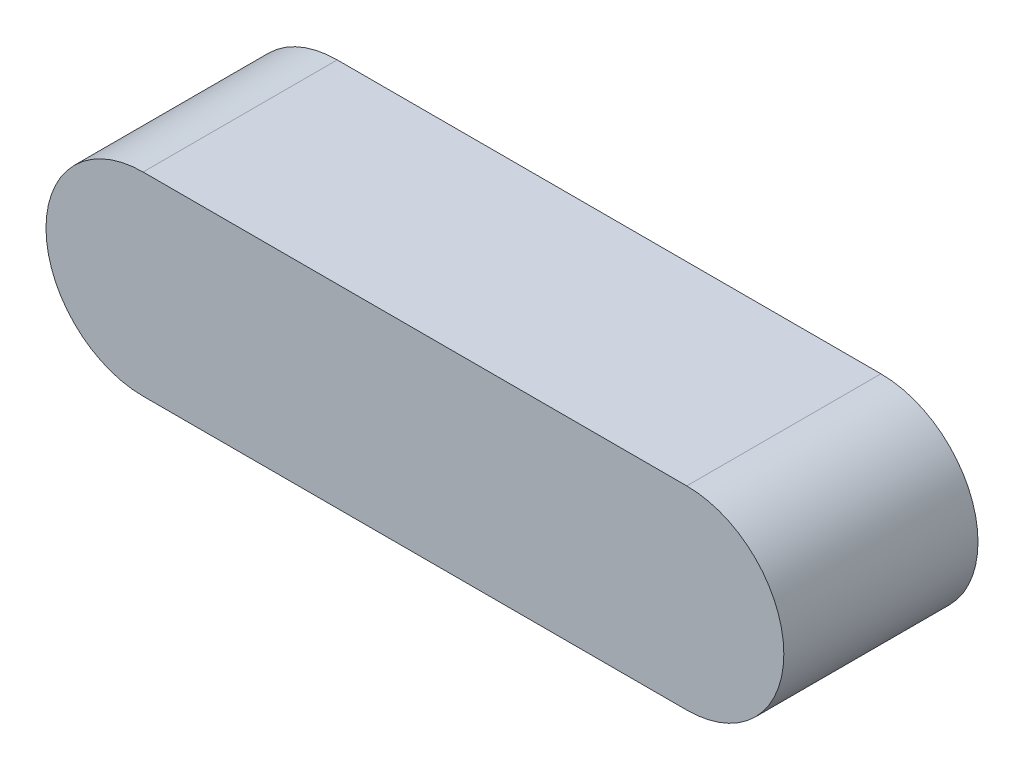
ISO-10303-21;
HEADER;
FILE_DESCRIPTION(('STEP AP214'),'2;1');
FILE_NAME('part.step','',(''),(''),'','','');
FILE_SCHEMA(('AUTOMOTIVE_DESIGN { 1 0 10303 214 1 1 1 1 }'));
ENDSEC;
DATA;
#1=APPLICATION_CONTEXT('core data for automotive mechanical design processes');
#2=APPLICATION_PROTOCOL_DEFINITION('international standard','automotive_design',2000,#1);
#3=PRODUCT_CONTEXT('',#1,'mechanical');
#4=PRODUCT('Part','Part','',(#3));
#5=PRODUCT_RELATED_PRODUCT_CATEGORY('part','',(#4));
#6=PRODUCT_DEFINITION_FORMATION('','',#4);
#7=PRODUCT_DEFINITION_CONTEXT('part definition',#1,'design');
#8=PRODUCT_DEFINITION('design','',#6,#7);
#9=PRODUCT_DEFINITION_SHAPE('','',#8);
#10=(LENGTH_UNIT() NAMED_UNIT(*) SI_UNIT(.MILLI.,.METRE.));
#11=(NAMED_UNIT(*) PLANE_ANGLE_UNIT() SI_UNIT($,.RADIAN.));
#12=(NAMED_UNIT(*) SI_UNIT($,.STERADIAN.) SOLID_ANGLE_UNIT());
#13=UNCERTAINTY_MEASURE_WITH_UNIT(LENGTH_MEASURE(1.E-05),#10,'distance_accuracy_value','');
#14=(GEOMETRIC_REPRESENTATION_CONTEXT(3) GLOBAL_UNCERTAINTY_ASSIGNED_CONTEXT((#13)) GLOBAL_UNIT_ASSIGNED_CONTEXT((#10,
#11,#12)) REPRESENTATION_CONTEXT('',''));
#15=CARTESIAN_POINT('',(0.,0.,0.));
#16=DIRECTION('',(0.,0.,1.));
#17=DIRECTION('',(1.,0.,0.));
#18=AXIS2_PLACEMENT_3D('',#15,#16,#17);
#19=CARTESIAN_POINT('',(-7.,0.,5.));
#20=DIRECTION('',(0.,0.,-1.));
#21=DIRECTION('',(-1.,0.,0.));
#22=AXIS2_PLACEMENT_3D('',#19,#20,#21);
#23=CYLINDRICAL_SURFACE('',#22,2.5);
#24=CARTESIAN_POINT('',(-7.,0.,0.));
#25=DIRECTION('',(0.,0.,1.));
#26=DIRECTION('',(1.,0.,0.));
#27=AXIS2_PLACEMENT_3D('',#24,#25,#26);
#28=CIRCLE('',#27,2.5);
#29=CARTESIAN_POINT('',(-7.00000000000001,2.5,0.));
#30=VERTEX_POINT('',#29);
#31=CARTESIAN_POINT('',(-7.00000000000001,-2.5,0.));
#32=VERTEX_POINT('',#31);
#33=EDGE_CURVE('E96',#30,#32,#28,.T.);
#34=ORIENTED_EDGE('',*,*,#33,.T.);
#35=DIRECTION('',(0.,0.,-1.));
#36=VECTOR('',#35,1.);
#37=CARTESIAN_POINT('',(-7.00000000000001,-2.5,5.));
#38=LINE('',#37,#36);
#39=CARTESIAN_POINT('',(-7.00000000000001,-2.5,5.));
#40=VERTEX_POINT('',#39);
#41=EDGE_CURVE('E11',#40,#32,#38,.T.);
#42=ORIENTED_EDGE('',*,*,#41,.F.);
#43=CARTESIAN_POINT('',(-7.,0.,5.));
#44=DIRECTION('',(0.,0.,1.));
#45=DIRECTION('',(1.,0.,0.));
#46=AXIS2_PLACEMENT_3D('',#43,#44,#45);
#47=CIRCLE('',#46,2.5);
#48=CARTESIAN_POINT('',(-7.00000000000001,2.5,5.));
#49=VERTEX_POINT('',#48);
#50=EDGE_CURVE('E82',#49,#40,#47,.T.);
#51=ORIENTED_EDGE('',*,*,#50,.F.);
#52=DIRECTION('',(0.,0.,-1.));
#53=VECTOR('',#52,1.);
#54=CARTESIAN_POINT('',(-7.00000000000001,2.5,5.));
#55=LINE('',#54,#53);
#56=EDGE_CURVE('E49',#49,#30,#55,.T.);
#57=ORIENTED_EDGE('',*,*,#56,.T.);
#58=EDGE_LOOP('',(#34,#42,#51,#57));
#59=FACE_BOUND('',#58,.T.);
#60=ADVANCED_FACE('F33',(#59),#23,.T.);
#61=CARTESIAN_POINT('',(0.,-2.5,5.));
#62=DIRECTION('',(0.,1.,0.));
#63=DIRECTION('',(0.,0.,1.));
#64=AXIS2_PLACEMENT_3D('',#61,#62,#63);
#65=PLANE('',#64);
#66=DIRECTION('',(1.,0.,0.));
#67=VECTOR('',#66,1.);
#68=CARTESIAN_POINT('',(0.,-2.5,0.));
#69=LINE('',#68,#67);
#70=CARTESIAN_POINT('',(6.99999999999999,-2.5,0.));
#71=VERTEX_POINT('',#70);
#72=EDGE_CURVE('E87',#32,#71,#69,.T.);
#73=ORIENTED_EDGE('',*,*,#72,.T.);
#74=DIRECTION('',(0.,0.,-1.));
#75=VECTOR('',#74,1.);
#76=CARTESIAN_POINT('',(6.99999999999999,-2.5,5.));
#77=LINE('',#76,#75);
#78=CARTESIAN_POINT('',(6.99999999999999,-2.5,5.));
#79=VERTEX_POINT('',#78);
#80=EDGE_CURVE('E41',#79,#71,#77,.T.);
#81=ORIENTED_EDGE('',*,*,#80,.F.);
#82=DIRECTION('',(1.,0.,0.));
#83=VECTOR('',#82,1.);
#84=CARTESIAN_POINT('',(0.,-2.5,5.));
#85=LINE('',#84,#83);
#86=EDGE_CURVE('E74',#40,#79,#85,.T.);
#87=ORIENTED_EDGE('',*,*,#86,.F.);
#88=ORIENTED_EDGE('',*,*,#41,.T.);
#89=EDGE_LOOP('',(#73,#81,#87,#88));
#90=FACE_BOUND('',#89,.T.);
#91=ADVANCED_FACE('F86',(#90),#65,.F.);
#92=CARTESIAN_POINT('',(7.,0.,5.));
#93=DIRECTION('',(0.,0.,-1.));
#94=DIRECTION('',(-1.,0.,0.));
#95=AXIS2_PLACEMENT_3D('',#92,#93,#94);
#96=CYLINDRICAL_SURFACE('',#95,2.5);
#97=CARTESIAN_POINT('',(7.,0.,0.));
#98=DIRECTION('',(0.,0.,1.));
#99=DIRECTION('',(1.,0.,0.));
#100=AXIS2_PLACEMENT_3D('',#97,#98,#99);
#101=CIRCLE('',#100,2.5);
#102=CARTESIAN_POINT('',(6.99999999999999,2.5,0.));
#103=VERTEX_POINT('',#102);
#104=EDGE_CURVE('E99',#103,#71,#101,.F.);
#105=ORIENTED_EDGE('',*,*,#104,.F.);
#106=DIRECTION('',(0.,0.,-1.));
#107=VECTOR('',#106,1.);
#108=CARTESIAN_POINT('',(6.99999999999999,2.5,5.));
#109=LINE('',#108,#107);
#110=CARTESIAN_POINT('',(6.99999999999999,2.5,5.));
#111=VERTEX_POINT('',#110);
#112=EDGE_CURVE('E63',#111,#103,#109,.T.);
#113=ORIENTED_EDGE('',*,*,#112,.F.);
#114=CARTESIAN_POINT('',(7.,0.,5.));
#115=DIRECTION('',(0.,0.,1.));
#116=DIRECTION('',(1.,0.,0.));
#117=AXIS2_PLACEMENT_3D('',#114,#115,#116);
#118=CIRCLE('',#117,2.5);
#119=EDGE_CURVE('E81',#111,#79,#118,.F.);
#120=ORIENTED_EDGE('',*,*,#119,.T.);
#121=ORIENTED_EDGE('',*,*,#80,.T.);
#122=EDGE_LOOP('',(#105,#113,#120,#121));
#123=FACE_BOUND('',#122,.T.);
#124=ADVANCED_FACE('F90',(#123),#96,.T.);
#125=CARTESIAN_POINT('',(0.,2.5,5.));
#126=DIRECTION('',(0.,1.,0.));
#127=DIRECTION('',(0.,0.,1.));
#128=AXIS2_PLACEMENT_3D('',#125,#126,#127);
#129=PLANE('',#128);
#130=DIRECTION('',(1.,0.,0.));
#131=VECTOR('',#130,1.);
#132=CARTESIAN_POINT('',(0.,2.5,0.));
#133=LINE('',#132,#131);
#134=EDGE_CURVE('E101',#30,#103,#133,.T.);
#135=ORIENTED_EDGE('',*,*,#134,.F.);
#136=ORIENTED_EDGE('',*,*,#56,.F.);
#137=DIRECTION('',(1.,0.,0.));
#138=VECTOR('',#137,1.);
#139=CARTESIAN_POINT('',(0.,2.5,5.));
#140=LINE('',#139,#138);
#141=EDGE_CURVE('E91',#49,#111,#140,.T.);
#142=ORIENTED_EDGE('',*,*,#141,.T.);
#143=ORIENTED_EDGE('',*,*,#112,.T.);
#144=EDGE_LOOP('',(#135,#136,#142,#143));
#145=FACE_BOUND('',#144,.T.);
#146=ADVANCED_FACE('F107',(#145),#129,.T.);
#147=CARTESIAN_POINT('',(0.,-15.4231097446321,5.));
#148=DIRECTION('',(0.,0.,1.));
#149=DIRECTION('',(1.,0.,0.));
#150=AXIS2_PLACEMENT_3D('',#147,#148,#149);
#151=PLANE('',#150);
#152=ORIENTED_EDGE('',*,*,#50,.T.);
#153=ORIENTED_EDGE('',*,*,#86,.T.);
#154=ORIENTED_EDGE('',*,*,#119,.F.);
#155=ORIENTED_EDGE('',*,*,#141,.F.);
#156=EDGE_LOOP('',(#152,#153,#154,#155));
#157=FACE_BOUND('',#156,.T.);
#158=ADVANCED_FACE('F78',(#157),#151,.T.);
#159=CARTESIAN_POINT('',(0.,-15.4231097446321,0.));
#160=DIRECTION('',(0.,0.,1.));
#161=DIRECTION('',(1.,0.,0.));
#162=AXIS2_PLACEMENT_3D('',#159,#160,#161);
#163=PLANE('',#162);
#164=ORIENTED_EDGE('',*,*,#33,.F.);
#165=ORIENTED_EDGE('',*,*,#134,.T.);
#166=ORIENTED_EDGE('',*,*,#104,.T.);
#167=ORIENTED_EDGE('',*,*,#72,.F.);
#168=EDGE_LOOP('',(#164,#165,#166,#167));
#169=FACE_BOUND('',#168,.T.);
#170=ADVANCED_FACE('F106',(#169),#163,.F.);
#171=CLOSED_SHELL('',(#60,#91,#124,#146,#158,#170));
#172=MANIFOLD_SOLID_BREP('B2',#171);
#173=ADVANCED_BREP_SHAPE_REPRESENTATION('',(#18,#172),#14);
#174=SHAPE_DEFINITION_REPRESENTATION(#9,#173);
ENDSEC;
END-ISO-10303-21;
